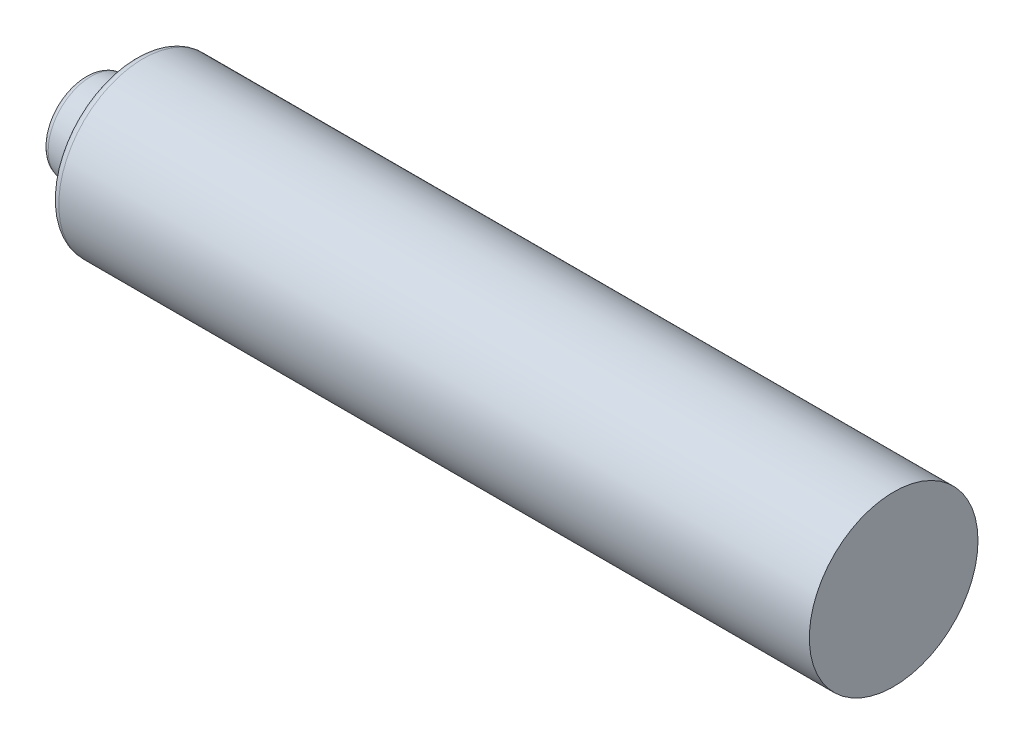
ISO-10303-21;
HEADER;
FILE_DESCRIPTION(('STEP AP214'),'2;1');
FILE_NAME('part.step','',(''),(''),'','','');
FILE_SCHEMA(('AUTOMOTIVE_DESIGN { 1 0 10303 214 1 1 1 1 }'));
ENDSEC;
DATA;
#1=APPLICATION_CONTEXT('core data for automotive mechanical design processes');
#2=APPLICATION_PROTOCOL_DEFINITION('international standard','automotive_design',2000,#1);
#3=PRODUCT_CONTEXT('',#1,'mechanical');
#4=PRODUCT('Part','Part','',(#3));
#5=PRODUCT_RELATED_PRODUCT_CATEGORY('part','',(#4));
#6=PRODUCT_DEFINITION_FORMATION('','',#4);
#7=PRODUCT_DEFINITION_CONTEXT('part definition',#1,'design');
#8=PRODUCT_DEFINITION('design','',#6,#7);
#9=PRODUCT_DEFINITION_SHAPE('','',#8);
#10=(LENGTH_UNIT() NAMED_UNIT(*) SI_UNIT(.MILLI.,.METRE.));
#11=(NAMED_UNIT(*) PLANE_ANGLE_UNIT() SI_UNIT($,.RADIAN.));
#12=(NAMED_UNIT(*) SI_UNIT($,.STERADIAN.) SOLID_ANGLE_UNIT());
#13=UNCERTAINTY_MEASURE_WITH_UNIT(LENGTH_MEASURE(1.E-05),#10,'distance_accuracy_value','');
#14=(GEOMETRIC_REPRESENTATION_CONTEXT(3) GLOBAL_UNCERTAINTY_ASSIGNED_CONTEXT((#13)) GLOBAL_UNIT_ASSIGNED_CONTEXT((#10,
#11,#12)) REPRESENTATION_CONTEXT('',''));
#15=CARTESIAN_POINT('',(0.,0.,0.));
#16=DIRECTION('',(0.,0.,1.));
#17=DIRECTION('',(1.,0.,0.));
#18=AXIS2_PLACEMENT_3D('',#15,#16,#17);
#19=CARTESIAN_POINT('',(45.,0.,0.));
#20=DIRECTION('',(-1.,0.,0.));
#21=DIRECTION('',(0.,0.,1.));
#22=AXIS2_PLACEMENT_3D('',#19,#20,#21);
#23=CYLINDRICAL_SURFACE('',#22,5.);
#24=CARTESIAN_POINT('',(0.5,0.,0.));
#25=DIRECTION('',(1.,0.,0.));
#26=DIRECTION('',(0.,0.,-1.));
#27=AXIS2_PLACEMENT_3D('',#24,#25,#26);
#28=CIRCLE('',#27,5.);
#29=CARTESIAN_POINT('',(0.5,0.,-5.));
#30=VERTEX_POINT('',#29);
#31=EDGE_CURVE('E44',#30,#30,#28,.T.);
#32=ORIENTED_EDGE('',*,*,#31,.T.);
#33=EDGE_LOOP('',(#32));
#34=FACE_BOUND('',#33,.T.);
#35=CARTESIAN_POINT('',(45.,0.,0.));
#36=DIRECTION('',(1.,0.,0.));
#37=DIRECTION('',(0.,0.,-1.));
#38=AXIS2_PLACEMENT_3D('',#35,#36,#37);
#39=CIRCLE('',#38,5.);
#40=CARTESIAN_POINT('',(45.,0.,-5.));
#41=VERTEX_POINT('',#40);
#42=EDGE_CURVE('E61',#41,#41,#39,.T.);
#43=ORIENTED_EDGE('',*,*,#42,.F.);
#44=EDGE_LOOP('',(#43));
#45=FACE_BOUND('',#44,.T.);
#46=ADVANCED_FACE('F36',(#34,#45),#23,.T.);
#47=CARTESIAN_POINT('',(45.,0.,0.));
#48=DIRECTION('',(1.,0.,0.));
#49=DIRECTION('',(0.,0.,-1.));
#50=AXIS2_PLACEMENT_3D('',#47,#48,#49);
#51=PLANE('',#50);
#52=ORIENTED_EDGE('',*,*,#42,.T.);
#53=EDGE_LOOP('',(#52));
#54=FACE_BOUND('',#53,.T.);
#55=ADVANCED_FACE('F73',(#54),#51,.T.);
#56=CARTESIAN_POINT('',(0.,0.,0.));
#57=DIRECTION('',(1.,0.,0.));
#58=DIRECTION('',(0.,0.,-1.));
#59=AXIS2_PLACEMENT_3D('',#56,#57,#58);
#60=PLANE('',#59);
#61=CARTESIAN_POINT('',(0.,0.,0.));
#62=DIRECTION('',(1.,0.,0.));
#63=DIRECTION('',(0.,0.,-1.));
#64=AXIS2_PLACEMENT_3D('',#61,#62,#63);
#65=CIRCLE('',#64,4.5);
#66=CARTESIAN_POINT('',(0.,0.,-4.5));
#67=VERTEX_POINT('',#66);
#68=EDGE_CURVE('E10',#67,#67,#65,.F.);
#69=ORIENTED_EDGE('',*,*,#68,.T.);
#70=EDGE_LOOP('',(#69));
#71=FACE_BOUND('',#70,.T.);
#72=CARTESIAN_POINT('',(0.,0.,0.));
#73=DIRECTION('',(-1.,0.,0.));
#74=DIRECTION('',(0.,0.,1.));
#75=AXIS2_PLACEMENT_3D('',#72,#73,#74);
#76=CIRCLE('',#75,3.);
#77=CARTESIAN_POINT('',(0.,0.,3.));
#78=VERTEX_POINT('',#77);
#79=EDGE_CURVE('E60',#78,#78,#76,.T.);
#80=ORIENTED_EDGE('',*,*,#79,.F.);
#81=EDGE_LOOP('',(#80));
#82=FACE_BOUND('',#81,.T.);
#83=ADVANCED_FACE('F71',(#71,#82),#60,.F.);
#84=CARTESIAN_POINT('',(0.,0.,0.));
#85=DIRECTION('',(1.,0.,0.));
#86=DIRECTION('',(0.,0.,1.));
#87=AXIS2_PLACEMENT_3D('',#84,#85,#86);
#88=CONICAL_SURFACE('',#87,3.,0.174532925199433);
#89=CARTESIAN_POINT('',(-2.58682408883347,0.,0.));
#90=DIRECTION('',(1.,0.,0.));
#91=DIRECTION('',(0.,0.,-1.));
#92=AXIS2_PLACEMENT_3D('',#89,#90,#91);
#93=CIRCLE('',#92,2.54387311879207);
#94=CARTESIAN_POINT('',(-2.58682408883347,0.,-2.54387311879207));
#95=VERTEX_POINT('',#94);
#96=EDGE_CURVE('E49',#95,#95,#93,.T.);
#97=ORIENTED_EDGE('',*,*,#96,.T.);
#98=EDGE_LOOP('',(#97));
#99=FACE_BOUND('',#98,.T.);
#100=ORIENTED_EDGE('',*,*,#79,.T.);
#101=EDGE_LOOP('',(#100));
#102=FACE_BOUND('',#101,.T.);
#103=ADVANCED_FACE('F69',(#99,#102),#88,.T.);
#104=CARTESIAN_POINT('',(-3.,0.,0.));
#105=DIRECTION('',(-1.,0.,0.));
#106=DIRECTION('',(0.,0.,1.));
#107=AXIS2_PLACEMENT_3D('',#104,#105,#106);
#108=PLANE('',#107);
#109=CARTESIAN_POINT('',(-3.,0.,0.));
#110=DIRECTION('',(-1.,0.,0.));
#111=DIRECTION('',(0.,0.,1.));
#112=AXIS2_PLACEMENT_3D('',#109,#110,#111);
#113=CIRCLE('',#112,2.05146924228596);
#114=CARTESIAN_POINT('',(-3.,0.,2.05146924228596));
#115=VERTEX_POINT('',#114);
#116=EDGE_CURVE('E54',#115,#115,#113,.T.);
#117=ORIENTED_EDGE('',*,*,#116,.T.);
#118=EDGE_LOOP('',(#117));
#119=FACE_BOUND('',#118,.T.);
#120=ADVANCED_FACE('F79',(#119),#108,.T.);
#121=CARTESIAN_POINT('',(-2.5,0.,0.));
#122=DIRECTION('',(-1.,0.,0.));
#123=DIRECTION('',(0.,0.,1.));
#124=AXIS2_PLACEMENT_3D('',#121,#122,#123);
#125=TOROIDAL_SURFACE('',#124,2.05146924228596,0.5);
#126=ORIENTED_EDGE('',*,*,#96,.F.);
#127=EDGE_LOOP('',(#126));
#128=FACE_BOUND('',#127,.T.);
#129=ORIENTED_EDGE('',*,*,#116,.F.);
#130=EDGE_LOOP('',(#129));
#131=FACE_BOUND('',#130,.T.);
#132=ADVANCED_FACE('F90',(#128,#131),#125,.T.);
#133=CARTESIAN_POINT('',(0.5,0.,0.));
#134=DIRECTION('',(1.,0.,0.));
#135=DIRECTION('',(0.,0.,-1.));
#136=AXIS2_PLACEMENT_3D('',#133,#134,#135);
#137=TOROIDAL_SURFACE('',#136,4.5,0.5);
#138=ORIENTED_EDGE('',*,*,#68,.F.);
#139=EDGE_LOOP('',(#138));
#140=FACE_BOUND('',#139,.T.);
#141=ORIENTED_EDGE('',*,*,#31,.F.);
#142=EDGE_LOOP('',(#141));
#143=FACE_BOUND('',#142,.T.);
#144=ADVANCED_FACE('F38',(#140,#143),#137,.T.);
#145=CLOSED_SHELL('',(#46,#55,#83,#103,#120,#132,#144));
#146=MANIFOLD_SOLID_BREP('B2',#145);
#147=ADVANCED_BREP_SHAPE_REPRESENTATION('',(#18,#146),#14);
#148=SHAPE_DEFINITION_REPRESENTATION(#9,#147);
ENDSEC;
END-ISO-10303-21;
